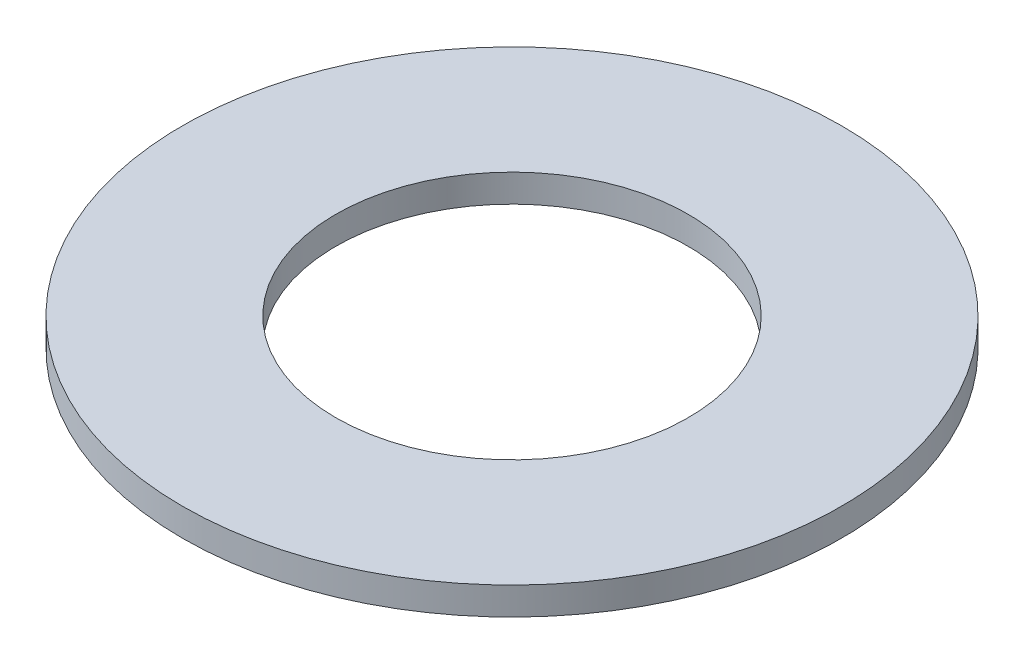
ISO-10303-21;
HEADER;
FILE_DESCRIPTION(('STEP AP214'),'2;1');
FILE_NAME('part.step','',(''),(''),'','','');
FILE_SCHEMA(('AUTOMOTIVE_DESIGN { 1 0 10303 214 1 1 1 1 }'));
ENDSEC;
DATA;
#1=APPLICATION_CONTEXT('core data for automotive mechanical design processes');
#2=APPLICATION_PROTOCOL_DEFINITION('international standard','automotive_design',2000,#1);
#3=PRODUCT_CONTEXT('',#1,'mechanical');
#4=PRODUCT('Part','Part','',(#3));
#5=PRODUCT_RELATED_PRODUCT_CATEGORY('part','',(#4));
#6=PRODUCT_DEFINITION_FORMATION('','',#4);
#7=PRODUCT_DEFINITION_CONTEXT('part definition',#1,'design');
#8=PRODUCT_DEFINITION('design','',#6,#7);
#9=PRODUCT_DEFINITION_SHAPE('','',#8);
#10=(LENGTH_UNIT() NAMED_UNIT(*) SI_UNIT(.MILLI.,.METRE.));
#11=(NAMED_UNIT(*) PLANE_ANGLE_UNIT() SI_UNIT($,.RADIAN.));
#12=(NAMED_UNIT(*) SI_UNIT($,.STERADIAN.) SOLID_ANGLE_UNIT());
#13=UNCERTAINTY_MEASURE_WITH_UNIT(LENGTH_MEASURE(1.E-05),#10,'distance_accuracy_value','');
#14=(GEOMETRIC_REPRESENTATION_CONTEXT(3) GLOBAL_UNCERTAINTY_ASSIGNED_CONTEXT((#13)) GLOBAL_UNIT_ASSIGNED_CONTEXT((#10,
#11,#12)) REPRESENTATION_CONTEXT('',''));
#15=CARTESIAN_POINT('',(0.,0.,0.));
#16=DIRECTION('',(0.,0.,1.));
#17=DIRECTION('',(1.,0.,0.));
#18=AXIS2_PLACEMENT_3D('',#15,#16,#17);
#19=CARTESIAN_POINT('',(0.,0.4,0.));
#20=DIRECTION('',(0.,-1.,0.));
#21=DIRECTION('',(0.,0.,-1.));
#22=AXIS2_PLACEMENT_3D('',#19,#20,#21);
#23=CYLINDRICAL_SURFACE('',#22,4.75);
#24=CARTESIAN_POINT('',(0.,0.4,0.));
#25=DIRECTION('',(0.,1.,0.));
#26=DIRECTION('',(0.,0.,1.));
#27=AXIS2_PLACEMENT_3D('',#24,#25,#26);
#28=CIRCLE('',#27,4.75);
#29=CARTESIAN_POINT('',(0.,0.4,4.75));
#30=VERTEX_POINT('',#29);
#31=EDGE_CURVE('E10',#30,#30,#28,.T.);
#32=ORIENTED_EDGE('',*,*,#31,.F.);
#33=EDGE_LOOP('',(#32));
#34=FACE_BOUND('',#33,.T.);
#35=CARTESIAN_POINT('',(0.,0.,0.));
#36=DIRECTION('',(0.,1.,0.));
#37=DIRECTION('',(0.,0.,1.));
#38=AXIS2_PLACEMENT_3D('',#35,#36,#37);
#39=CIRCLE('',#38,4.75);
#40=CARTESIAN_POINT('',(0.,0.,4.75));
#41=VERTEX_POINT('',#40);
#42=EDGE_CURVE('E40',#41,#41,#39,.T.);
#43=ORIENTED_EDGE('',*,*,#42,.T.);
#44=EDGE_LOOP('',(#43));
#45=FACE_BOUND('',#44,.T.);
#46=ADVANCED_FACE('F37',(#34,#45),#23,.T.);
#47=CARTESIAN_POINT('',(0.,0.4,0.));
#48=DIRECTION('',(0.,1.,0.));
#49=DIRECTION('',(0.,0.,1.));
#50=AXIS2_PLACEMENT_3D('',#47,#48,#49);
#51=PLANE('',#50);
#52=CARTESIAN_POINT('',(0.,0.4,0.));
#53=DIRECTION('',(0.,1.,0.));
#54=DIRECTION('',(0.,0.,1.));
#55=AXIS2_PLACEMENT_3D('',#52,#53,#54);
#56=CIRCLE('',#55,2.54);
#57=CARTESIAN_POINT('',(0.,0.4,2.54));
#58=VERTEX_POINT('',#57);
#59=EDGE_CURVE('E51',#58,#58,#56,.T.);
#60=ORIENTED_EDGE('',*,*,#59,.F.);
#61=EDGE_LOOP('',(#60));
#62=FACE_BOUND('',#61,.T.);
#63=ORIENTED_EDGE('',*,*,#31,.T.);
#64=EDGE_LOOP('',(#63));
#65=FACE_BOUND('',#64,.T.);
#66=ADVANCED_FACE('F68',(#62,#65),#51,.T.);
#67=CARTESIAN_POINT('',(0.,0.,0.));
#68=DIRECTION('',(0.,1.,0.));
#69=DIRECTION('',(0.,0.,1.));
#70=AXIS2_PLACEMENT_3D('',#67,#68,#69);
#71=PLANE('',#70);
#72=CARTESIAN_POINT('',(0.,0.,0.));
#73=DIRECTION('',(0.,1.,0.));
#74=DIRECTION('',(0.,0.,1.));
#75=AXIS2_PLACEMENT_3D('',#72,#73,#74);
#76=CIRCLE('',#75,2.54);
#77=CARTESIAN_POINT('',(0.,0.,2.54));
#78=VERTEX_POINT('',#77);
#79=EDGE_CURVE('E49',#78,#78,#76,.T.);
#80=ORIENTED_EDGE('',*,*,#79,.T.);
#81=EDGE_LOOP('',(#80));
#82=FACE_BOUND('',#81,.T.);
#83=ORIENTED_EDGE('',*,*,#42,.F.);
#84=EDGE_LOOP('',(#83));
#85=FACE_BOUND('',#84,.T.);
#86=ADVANCED_FACE('F59',(#82,#85),#71,.F.);
#87=CARTESIAN_POINT('',(0.,0.,0.));
#88=DIRECTION('',(0.,1.,0.));
#89=DIRECTION('',(0.,0.,1.));
#90=AXIS2_PLACEMENT_3D('',#87,#88,#89);
#91=CYLINDRICAL_SURFACE('',#90,2.54);
#92=ORIENTED_EDGE('',*,*,#79,.F.);
#93=EDGE_LOOP('',(#92));
#94=FACE_BOUND('',#93,.T.);
#95=ORIENTED_EDGE('',*,*,#59,.T.);
#96=EDGE_LOOP('',(#95));
#97=FACE_BOUND('',#96,.T.);
#98=ADVANCED_FACE('F62',(#94,#97),#91,.F.);
#99=CLOSED_SHELL('',(#46,#66,#86,#98));
#100=MANIFOLD_SOLID_BREP('B2',#99);
#101=ADVANCED_BREP_SHAPE_REPRESENTATION('',(#18,#100),#14);
#102=SHAPE_DEFINITION_REPRESENTATION(#9,#101);
ENDSEC;
END-ISO-10303-21;
